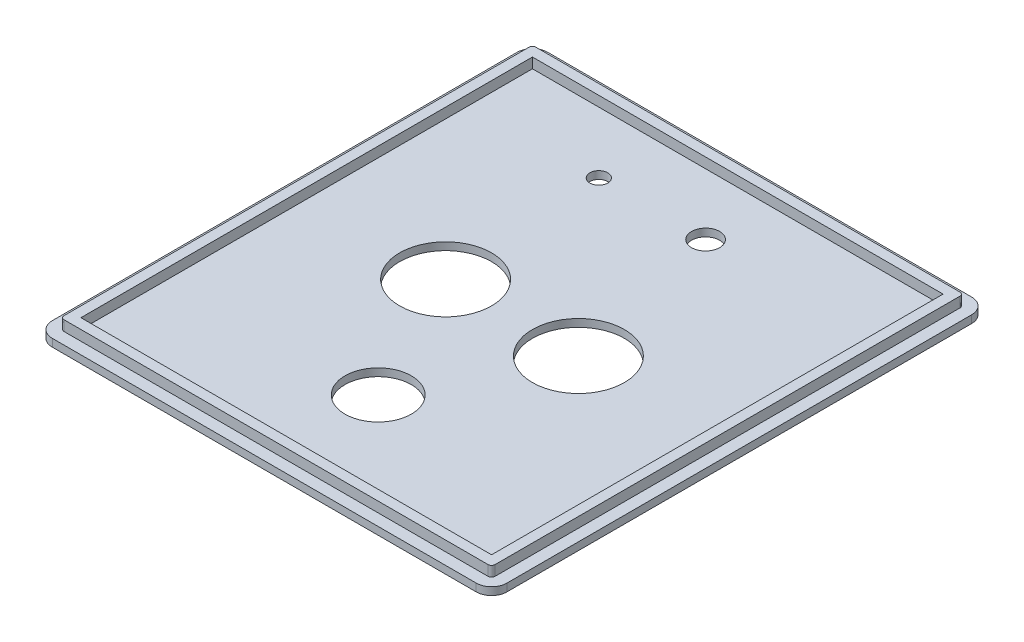
ISO-10303-21;
HEADER;
FILE_DESCRIPTION(('STEP AP214'),'2;1');
FILE_NAME('part.step','',(''),(''),'','','');
FILE_SCHEMA(('AUTOMOTIVE_DESIGN { 1 0 10303 214 1 1 1 1 }'));
ENDSEC;
DATA;
#1=APPLICATION_CONTEXT('core data for automotive mechanical design processes');
#2=APPLICATION_PROTOCOL_DEFINITION('international standard','automotive_design',2000,#1);
#3=PRODUCT_CONTEXT('',#1,'mechanical');
#4=PRODUCT('Part','Part','',(#3));
#5=PRODUCT_RELATED_PRODUCT_CATEGORY('part','',(#4));
#6=PRODUCT_DEFINITION_FORMATION('','',#4);
#7=PRODUCT_DEFINITION_CONTEXT('part definition',#1,'design');
#8=PRODUCT_DEFINITION('design','',#6,#7);
#9=PRODUCT_DEFINITION_SHAPE('','',#8);
#10=(LENGTH_UNIT() NAMED_UNIT(*) SI_UNIT(.MILLI.,.METRE.));
#11=(NAMED_UNIT(*) PLANE_ANGLE_UNIT() SI_UNIT($,.RADIAN.));
#12=(NAMED_UNIT(*) SI_UNIT($,.STERADIAN.) SOLID_ANGLE_UNIT());
#13=UNCERTAINTY_MEASURE_WITH_UNIT(LENGTH_MEASURE(1.E-05),#10,'distance_accuracy_value','');
#14=(GEOMETRIC_REPRESENTATION_CONTEXT(3) GLOBAL_UNCERTAINTY_ASSIGNED_CONTEXT((#13)) GLOBAL_UNIT_ASSIGNED_CONTEXT((#10,
#11,#12)) REPRESENTATION_CONTEXT('',''));
#15=CARTESIAN_POINT('',(0.,0.,0.));
#16=DIRECTION('',(0.,0.,1.));
#17=DIRECTION('',(1.,0.,0.));
#18=AXIS2_PLACEMENT_3D('',#15,#16,#17);
#19=CARTESIAN_POINT('',(3.,1.5,-94.));
#20=DIRECTION('',(0.,-1.,0.));
#21=DIRECTION('',(0.,0.,-1.));
#22=AXIS2_PLACEMENT_3D('',#19,#20,#21);
#23=PLANE('',#22);
#24=CARTESIAN_POINT('',(3.,1.5,-94.));
#25=DIRECTION('',(0.,1.,0.));
#26=DIRECTION('',(0.,0.,-1.));
#27=AXIS2_PLACEMENT_3D('',#24,#25,#26);
#28=CIRCLE('',#27,3.);
#29=CARTESIAN_POINT('',(3.00000000000002,1.5,-97.));
#30=VERTEX_POINT('',#29);
#31=CARTESIAN_POINT('',(0.,1.5,-94.));
#32=VERTEX_POINT('',#31);
#33=EDGE_CURVE('E274',#30,#32,#28,.T.);
#34=ORIENTED_EDGE('',*,*,#33,.T.);
#35=DIRECTION('',(0.,0.,1.));
#36=VECTOR('',#35,1.);
#37=CARTESIAN_POINT('',(0.,1.5,-3.00000000000002));
#38=LINE('',#37,#36);
#39=CARTESIAN_POINT('',(0.,1.5,-3.00000000000002));
#40=VERTEX_POINT('',#39);
#41=EDGE_CURVE('E277',#32,#40,#38,.T.);
#42=ORIENTED_EDGE('',*,*,#41,.T.);
#43=CARTESIAN_POINT('',(3.,1.5,-3.));
#44=DIRECTION('',(0.,1.,0.));
#45=DIRECTION('',(0.,0.,-1.));
#46=AXIS2_PLACEMENT_3D('',#43,#44,#45);
#47=CIRCLE('',#46,3.);
#48=CARTESIAN_POINT('',(3.00000000000002,1.5,0.));
#49=VERTEX_POINT('',#48);
#50=EDGE_CURVE('E280',#40,#49,#47,.T.);
#51=ORIENTED_EDGE('',*,*,#50,.T.);
#52=DIRECTION('',(1.,0.,0.));
#53=VECTOR('',#52,1.);
#54=CARTESIAN_POINT('',(3.00000000000002,1.5,0.));
#55=LINE('',#54,#53);
#56=CARTESIAN_POINT('',(86.,1.5,0.));
#57=VERTEX_POINT('',#56);
#58=EDGE_CURVE('E282',#49,#57,#55,.T.);
#59=ORIENTED_EDGE('',*,*,#58,.T.);
#60=CARTESIAN_POINT('',(86.,1.5,-3.));
#61=DIRECTION('',(0.,1.,0.));
#62=DIRECTION('',(0.,0.,1.));
#63=AXIS2_PLACEMENT_3D('',#60,#61,#62);
#64=CIRCLE('',#63,3.);
#65=CARTESIAN_POINT('',(89.,1.5,-3.00000000000002));
#66=VERTEX_POINT('',#65);
#67=EDGE_CURVE('E284',#57,#66,#64,.T.);
#68=ORIENTED_EDGE('',*,*,#67,.T.);
#69=DIRECTION('',(0.,0.,-1.));
#70=VECTOR('',#69,1.);
#71=CARTESIAN_POINT('',(89.,1.5,-3.00000000000002));
#72=LINE('',#71,#70);
#73=CARTESIAN_POINT('',(89.,1.5,-94.));
#74=VERTEX_POINT('',#73);
#75=EDGE_CURVE('E286',#66,#74,#72,.T.);
#76=ORIENTED_EDGE('',*,*,#75,.T.);
#77=CARTESIAN_POINT('',(86.,1.5,-94.));
#78=DIRECTION('',(0.,1.,0.));
#79=DIRECTION('',(0.,0.,-1.));
#80=AXIS2_PLACEMENT_3D('',#77,#78,#79);
#81=CIRCLE('',#80,3.);
#82=CARTESIAN_POINT('',(86.,1.5,-97.));
#83=VERTEX_POINT('',#82);
#84=EDGE_CURVE('E288',#74,#83,#81,.T.);
#85=ORIENTED_EDGE('',*,*,#84,.T.);
#86=DIRECTION('',(-1.,0.,0.));
#87=VECTOR('',#86,1.);
#88=CARTESIAN_POINT('',(3.00000000000002,1.5,-97.));
#89=LINE('',#88,#87);
#90=EDGE_CURVE('E290',#83,#30,#89,.T.);
#91=ORIENTED_EDGE('',*,*,#90,.T.);
#92=EDGE_LOOP('',(#34,#42,#51,#59,#68,#76,#85,#91));
#93=FACE_BOUND('',#92,.T.);
#94=CARTESIAN_POINT('',(3.,1.5,-94.));
#95=DIRECTION('',(0.,1.,0.));
#96=DIRECTION('',(0.,0.,1.));
#97=AXIS2_PLACEMENT_3D('',#94,#95,#96);
#98=CIRCLE('',#97,0.700000000000004);
#99=CARTESIAN_POINT('',(3.00000000000001,1.5,-94.7));
#100=VERTEX_POINT('',#99);
#101=CARTESIAN_POINT('',(2.3,1.5,-94.));
#102=VERTEX_POINT('',#101);
#103=EDGE_CURVE('E56',#100,#102,#98,.T.);
#104=ORIENTED_EDGE('',*,*,#103,.F.);
#105=DIRECTION('',(-1.,0.,0.));
#106=VECTOR('',#105,1.);
#107=CARTESIAN_POINT('',(86.,1.5,-94.7));
#108=LINE('',#107,#106);
#109=CARTESIAN_POINT('',(86.,1.5,-94.7));
#110=VERTEX_POINT('',#109);
#111=EDGE_CURVE('E215',#110,#100,#108,.T.);
#112=ORIENTED_EDGE('',*,*,#111,.F.);
#113=CARTESIAN_POINT('',(86.,1.5,-94.));
#114=DIRECTION('',(0.,1.,0.));
#115=DIRECTION('',(0.,0.,1.));
#116=AXIS2_PLACEMENT_3D('',#113,#114,#115);
#117=CIRCLE('',#116,0.700000000000006);
#118=CARTESIAN_POINT('',(86.7,1.5,-94.));
#119=VERTEX_POINT('',#118);
#120=EDGE_CURVE('E246',#119,#110,#117,.T.);
#121=ORIENTED_EDGE('',*,*,#120,.F.);
#122=DIRECTION('',(0.,0.,-1.));
#123=VECTOR('',#122,1.);
#124=CARTESIAN_POINT('',(86.7,1.5,-3.));
#125=LINE('',#124,#123);
#126=CARTESIAN_POINT('',(86.7,1.5,-3.));
#127=VERTEX_POINT('',#126);
#128=EDGE_CURVE('E243',#127,#119,#125,.T.);
#129=ORIENTED_EDGE('',*,*,#128,.F.);
#130=CARTESIAN_POINT('',(86.,1.5,-3.));
#131=DIRECTION('',(0.,1.,0.));
#132=DIRECTION('',(0.,0.,1.));
#133=AXIS2_PLACEMENT_3D('',#130,#131,#132);
#134=CIRCLE('',#133,0.700000000000004);
#135=CARTESIAN_POINT('',(86.,1.5,-2.3));
#136=VERTEX_POINT('',#135);
#137=EDGE_CURVE('E240',#136,#127,#134,.T.);
#138=ORIENTED_EDGE('',*,*,#137,.F.);
#139=DIRECTION('',(1.,0.,0.));
#140=VECTOR('',#139,1.);
#141=CARTESIAN_POINT('',(3.,1.5,-2.3));
#142=LINE('',#141,#140);
#143=CARTESIAN_POINT('',(3.,1.5,-2.3));
#144=VERTEX_POINT('',#143);
#145=EDGE_CURVE('E237',#144,#136,#142,.T.);
#146=ORIENTED_EDGE('',*,*,#145,.F.);
#147=CARTESIAN_POINT('',(3.,1.5,-3.));
#148=DIRECTION('',(0.,1.,0.));
#149=DIRECTION('',(0.,0.,1.));
#150=AXIS2_PLACEMENT_3D('',#147,#148,#149);
#151=CIRCLE('',#150,0.7);
#152=CARTESIAN_POINT('',(2.3,1.5,-3.));
#153=VERTEX_POINT('',#152);
#154=EDGE_CURVE('E234',#153,#144,#151,.T.);
#155=ORIENTED_EDGE('',*,*,#154,.F.);
#156=DIRECTION('',(0.,0.,1.));
#157=VECTOR('',#156,1.);
#158=CARTESIAN_POINT('',(2.3,1.5,-94.));
#159=LINE('',#158,#157);
#160=EDGE_CURVE('E231',#102,#153,#159,.T.);
#161=ORIENTED_EDGE('',*,*,#160,.F.);
#162=EDGE_LOOP('',(#104,#112,#121,#129,#138,#146,#155,#161));
#163=FACE_BOUND('',#162,.T.);
#164=ADVANCED_FACE('F33',(#93,#163),#23,.F.);
#165=CARTESIAN_POINT('',(3.,1.5,-94.));
#166=DIRECTION('',(0.,-1.,0.));
#167=DIRECTION('',(0.,0.,-1.));
#168=AXIS2_PLACEMENT_3D('',#165,#166,#167);
#169=CYLINDRICAL_SURFACE('',#168,3.);
#170=CARTESIAN_POINT('',(3.,0.,-94.));
#171=DIRECTION('',(0.,1.,0.));
#172=DIRECTION('',(0.,0.,-1.));
#173=AXIS2_PLACEMENT_3D('',#170,#171,#172);
#174=CIRCLE('',#173,3.);
#175=CARTESIAN_POINT('',(3.00000000000002,0.,-97.));
#176=VERTEX_POINT('',#175);
#177=CARTESIAN_POINT('',(0.,0.,-94.));
#178=VERTEX_POINT('',#177);
#179=EDGE_CURVE('E273',#176,#178,#174,.T.);
#180=ORIENTED_EDGE('',*,*,#179,.T.);
#181=DIRECTION('',(0.,-1.,0.));
#182=VECTOR('',#181,1.);
#183=CARTESIAN_POINT('',(0.,1.5,-94.));
#184=LINE('',#183,#182);
#185=EDGE_CURVE('E11',#32,#178,#184,.T.);
#186=ORIENTED_EDGE('',*,*,#185,.F.);
#187=ORIENTED_EDGE('',*,*,#33,.F.);
#188=DIRECTION('',(0.,-1.,0.));
#189=VECTOR('',#188,1.);
#190=CARTESIAN_POINT('',(3.00000000000002,1.5,-97.));
#191=LINE('',#190,#189);
#192=EDGE_CURVE('E292',#30,#176,#191,.T.);
#193=ORIENTED_EDGE('',*,*,#192,.T.);
#194=EDGE_LOOP('',(#180,#186,#187,#193));
#195=FACE_BOUND('',#194,.T.);
#196=ADVANCED_FACE('F35',(#195),#169,.T.);
#197=CARTESIAN_POINT('',(0.,1.5,-3.00000000000002));
#198=DIRECTION('',(1.,0.,0.));
#199=DIRECTION('',(0.,0.,-1.));
#200=AXIS2_PLACEMENT_3D('',#197,#198,#199);
#201=PLANE('',#200);
#202=DIRECTION('',(0.,0.,1.));
#203=VECTOR('',#202,1.);
#204=CARTESIAN_POINT('',(0.,0.,-3.00000000000002));
#205=LINE('',#204,#203);
#206=CARTESIAN_POINT('',(0.,0.,-3.00000000000002));
#207=VERTEX_POINT('',#206);
#208=EDGE_CURVE('E295',#178,#207,#205,.T.);
#209=ORIENTED_EDGE('',*,*,#208,.T.);
#210=DIRECTION('',(0.,-1.,0.));
#211=VECTOR('',#210,1.);
#212=CARTESIAN_POINT('',(0.,1.5,-3.00000000000002));
#213=LINE('',#212,#211);
#214=EDGE_CURVE('E41',#40,#207,#213,.T.);
#215=ORIENTED_EDGE('',*,*,#214,.F.);
#216=ORIENTED_EDGE('',*,*,#41,.F.);
#217=ORIENTED_EDGE('',*,*,#185,.T.);
#218=EDGE_LOOP('',(#209,#215,#216,#217));
#219=FACE_BOUND('',#218,.T.);
#220=ADVANCED_FACE('F351',(#219),#201,.F.);
#221=CARTESIAN_POINT('',(3.,1.5,-3.));
#222=DIRECTION('',(0.,-1.,0.));
#223=DIRECTION('',(0.,0.,-1.));
#224=AXIS2_PLACEMENT_3D('',#221,#222,#223);
#225=CYLINDRICAL_SURFACE('',#224,3.);
#226=CARTESIAN_POINT('',(3.,0.,-3.));
#227=DIRECTION('',(0.,1.,0.));
#228=DIRECTION('',(0.,0.,-1.));
#229=AXIS2_PLACEMENT_3D('',#226,#227,#228);
#230=CIRCLE('',#229,3.);
#231=CARTESIAN_POINT('',(3.00000000000002,0.,0.));
#232=VERTEX_POINT('',#231);
#233=EDGE_CURVE('E297',#207,#232,#230,.T.);
#234=ORIENTED_EDGE('',*,*,#233,.T.);
#235=DIRECTION('',(0.,-1.,0.));
#236=VECTOR('',#235,1.);
#237=CARTESIAN_POINT('',(3.00000000000002,1.5,0.));
#238=LINE('',#237,#236);
#239=EDGE_CURVE('E322',#49,#232,#238,.T.);
#240=ORIENTED_EDGE('',*,*,#239,.F.);
#241=ORIENTED_EDGE('',*,*,#50,.F.);
#242=ORIENTED_EDGE('',*,*,#214,.T.);
#243=EDGE_LOOP('',(#234,#240,#241,#242));
#244=FACE_BOUND('',#243,.T.);
#245=ADVANCED_FACE('F329',(#244),#225,.T.);
#246=CARTESIAN_POINT('',(3.00000000000002,1.5,0.));
#247=DIRECTION('',(0.,0.,-1.));
#248=DIRECTION('',(-1.,0.,0.));
#249=AXIS2_PLACEMENT_3D('',#246,#247,#248);
#250=PLANE('',#249);
#251=DIRECTION('',(1.,0.,0.));
#252=VECTOR('',#251,1.);
#253=CARTESIAN_POINT('',(3.00000000000002,0.,0.));
#254=LINE('',#253,#252);
#255=CARTESIAN_POINT('',(86.,0.,0.));
#256=VERTEX_POINT('',#255);
#257=EDGE_CURVE('E299',#232,#256,#254,.T.);
#258=ORIENTED_EDGE('',*,*,#257,.T.);
#259=DIRECTION('',(0.,-1.,0.));
#260=VECTOR('',#259,1.);
#261=CARTESIAN_POINT('',(86.,1.5,0.));
#262=LINE('',#261,#260);
#263=EDGE_CURVE('E319',#57,#256,#262,.T.);
#264=ORIENTED_EDGE('',*,*,#263,.F.);
#265=ORIENTED_EDGE('',*,*,#58,.F.);
#266=ORIENTED_EDGE('',*,*,#239,.T.);
#267=EDGE_LOOP('',(#258,#264,#265,#266));
#268=FACE_BOUND('',#267,.T.);
#269=ADVANCED_FACE('F340',(#268),#250,.F.);
#270=CARTESIAN_POINT('',(86.,1.5,-3.));
#271=DIRECTION('',(0.,-1.,0.));
#272=DIRECTION('',(0.,0.,-1.));
#273=AXIS2_PLACEMENT_3D('',#270,#271,#272);
#274=CYLINDRICAL_SURFACE('',#273,3.);
#275=CARTESIAN_POINT('',(86.,0.,-3.));
#276=DIRECTION('',(0.,1.,0.));
#277=DIRECTION('',(0.,0.,1.));
#278=AXIS2_PLACEMENT_3D('',#275,#276,#277);
#279=CIRCLE('',#278,3.);
#280=CARTESIAN_POINT('',(89.,0.,-3.00000000000002));
#281=VERTEX_POINT('',#280);
#282=EDGE_CURVE('E301',#256,#281,#279,.T.);
#283=ORIENTED_EDGE('',*,*,#282,.T.);
#284=DIRECTION('',(0.,-1.,0.));
#285=VECTOR('',#284,1.);
#286=CARTESIAN_POINT('',(89.,1.5,-3.00000000000002));
#287=LINE('',#286,#285);
#288=EDGE_CURVE('E316',#66,#281,#287,.T.);
#289=ORIENTED_EDGE('',*,*,#288,.F.);
#290=ORIENTED_EDGE('',*,*,#67,.F.);
#291=ORIENTED_EDGE('',*,*,#263,.T.);
#292=EDGE_LOOP('',(#283,#289,#290,#291));
#293=FACE_BOUND('',#292,.T.);
#294=ADVANCED_FACE('F344',(#293),#274,.T.);
#295=CARTESIAN_POINT('',(89.,1.5,-3.00000000000002));
#296=DIRECTION('',(-1.,0.,0.));
#297=DIRECTION('',(0.,0.,1.));
#298=AXIS2_PLACEMENT_3D('',#295,#296,#297);
#299=PLANE('',#298);
#300=DIRECTION('',(0.,0.,-1.));
#301=VECTOR('',#300,1.);
#302=CARTESIAN_POINT('',(89.,0.,-3.00000000000002));
#303=LINE('',#302,#301);
#304=CARTESIAN_POINT('',(89.,0.,-94.));
#305=VERTEX_POINT('',#304);
#306=EDGE_CURVE('E303',#281,#305,#303,.T.);
#307=ORIENTED_EDGE('',*,*,#306,.T.);
#308=DIRECTION('',(0.,-1.,0.));
#309=VECTOR('',#308,1.);
#310=CARTESIAN_POINT('',(89.,1.5,-94.));
#311=LINE('',#310,#309);
#312=EDGE_CURVE('E313',#74,#305,#311,.T.);
#313=ORIENTED_EDGE('',*,*,#312,.F.);
#314=ORIENTED_EDGE('',*,*,#75,.F.);
#315=ORIENTED_EDGE('',*,*,#288,.T.);
#316=EDGE_LOOP('',(#307,#313,#314,#315));
#317=FACE_BOUND('',#316,.T.);
#318=ADVANCED_FACE('F364',(#317),#299,.F.);
#319=CARTESIAN_POINT('',(86.,1.5,-94.));
#320=DIRECTION('',(0.,-1.,0.));
#321=DIRECTION('',(0.,0.,-1.));
#322=AXIS2_PLACEMENT_3D('',#319,#320,#321);
#323=CYLINDRICAL_SURFACE('',#322,3.);
#324=CARTESIAN_POINT('',(86.,0.,-94.));
#325=DIRECTION('',(0.,1.,0.));
#326=DIRECTION('',(0.,0.,-1.));
#327=AXIS2_PLACEMENT_3D('',#324,#325,#326);
#328=CIRCLE('',#327,3.);
#329=CARTESIAN_POINT('',(86.,0.,-97.));
#330=VERTEX_POINT('',#329);
#331=EDGE_CURVE('E305',#305,#330,#328,.T.);
#332=ORIENTED_EDGE('',*,*,#331,.T.);
#333=DIRECTION('',(0.,-1.,0.));
#334=VECTOR('',#333,1.);
#335=CARTESIAN_POINT('',(86.,1.5,-97.));
#336=LINE('',#335,#334);
#337=EDGE_CURVE('E310',#83,#330,#336,.T.);
#338=ORIENTED_EDGE('',*,*,#337,.F.);
#339=ORIENTED_EDGE('',*,*,#84,.F.);
#340=ORIENTED_EDGE('',*,*,#312,.T.);
#341=EDGE_LOOP('',(#332,#338,#339,#340));
#342=FACE_BOUND('',#341,.T.);
#343=ADVANCED_FACE('F362',(#342),#323,.T.);
#344=CARTESIAN_POINT('',(3.00000000000002,1.5,-97.));
#345=DIRECTION('',(0.,0.,1.));
#346=DIRECTION('',(1.,0.,0.));
#347=AXIS2_PLACEMENT_3D('',#344,#345,#346);
#348=PLANE('',#347);
#349=DIRECTION('',(-1.,0.,0.));
#350=VECTOR('',#349,1.);
#351=CARTESIAN_POINT('',(3.00000000000002,0.,-97.));
#352=LINE('',#351,#350);
#353=EDGE_CURVE('E278',#330,#176,#352,.T.);
#354=ORIENTED_EDGE('',*,*,#353,.T.);
#355=ORIENTED_EDGE('',*,*,#192,.F.);
#356=ORIENTED_EDGE('',*,*,#90,.F.);
#357=ORIENTED_EDGE('',*,*,#337,.T.);
#358=EDGE_LOOP('',(#354,#355,#356,#357));
#359=FACE_BOUND('',#358,.T.);
#360=ADVANCED_FACE('F357',(#359),#348,.F.);
#361=CARTESIAN_POINT('',(3.,0.,-94.));
#362=DIRECTION('',(0.,-1.,0.));
#363=DIRECTION('',(0.,0.,-1.));
#364=AXIS2_PLACEMENT_3D('',#361,#362,#363);
#365=PLANE('',#364);
#366=CARTESIAN_POINT('',(44.5,0.,-22.3));
#367=DIRECTION('',(0.,-1.,0.));
#368=DIRECTION('',(0.,0.,-1.));
#369=AXIS2_PLACEMENT_3D('',#366,#367,#368);
#370=CIRCLE('',#369,6.5);
#371=CARTESIAN_POINT('',(44.5,0.,-28.8));
#372=VERTEX_POINT('',#371);
#373=EDGE_CURVE('E632',#372,#372,#370,.T.);
#374=ORIENTED_EDGE('',*,*,#373,.F.);
#375=EDGE_LOOP('',(#374));
#376=FACE_BOUND('',#375,.T.);
#377=CARTESIAN_POINT('',(29.3,0.,-80.7));
#378=DIRECTION('',(0.,-1.,0.));
#379=DIRECTION('',(0.,0.,-1.));
#380=AXIS2_PLACEMENT_3D('',#377,#378,#379);
#381=CIRCLE('',#380,1.75);
#382=CARTESIAN_POINT('',(29.3,0.,-82.45));
#383=VERTEX_POINT('',#382);
#384=EDGE_CURVE('E648',#383,#383,#381,.T.);
#385=ORIENTED_EDGE('',*,*,#384,.F.);
#386=EDGE_LOOP('',(#385));
#387=FACE_BOUND('',#386,.T.);
#388=CARTESIAN_POINT('',(50.2,0.,-80.7));
#389=DIRECTION('',(0.,-1.,0.));
#390=DIRECTION('',(0.,0.,-1.));
#391=AXIS2_PLACEMENT_3D('',#388,#389,#390);
#392=CIRCLE('',#391,2.75);
#393=CARTESIAN_POINT('',(50.2,0.,-83.45));
#394=VERTEX_POINT('',#393);
#395=EDGE_CURVE('E643',#394,#394,#392,.T.);
#396=ORIENTED_EDGE('',*,*,#395,.F.);
#397=EDGE_LOOP('',(#396));
#398=FACE_BOUND('',#397,.T.);
#399=CARTESIAN_POINT('',(31.5,0.,-48.5));
#400=DIRECTION('',(0.,-1.,0.));
#401=DIRECTION('',(0.,0.,-1.));
#402=AXIS2_PLACEMENT_3D('',#399,#400,#401);
#403=CIRCLE('',#402,9.00000000000001);
#404=CARTESIAN_POINT('',(31.5,0.,-57.5));
#405=VERTEX_POINT('',#404);
#406=EDGE_CURVE('E196',#405,#405,#403,.T.);
#407=ORIENTED_EDGE('',*,*,#406,.F.);
#408=EDGE_LOOP('',(#407));
#409=FACE_BOUND('',#408,.T.);
#410=CARTESIAN_POINT('',(57.5,0.,-48.5));
#411=DIRECTION('',(0.,-1.,0.));
#412=DIRECTION('',(0.,0.,-1.));
#413=AXIS2_PLACEMENT_3D('',#410,#411,#412);
#414=CIRCLE('',#413,9.00000000000001);
#415=CARTESIAN_POINT('',(57.5,0.,-57.5));
#416=VERTEX_POINT('',#415);
#417=EDGE_CURVE('E655',#416,#416,#414,.T.);
#418=ORIENTED_EDGE('',*,*,#417,.F.);
#419=EDGE_LOOP('',(#418));
#420=FACE_BOUND('',#419,.T.);
#421=ORIENTED_EDGE('',*,*,#179,.F.);
#422=ORIENTED_EDGE('',*,*,#353,.F.);
#423=ORIENTED_EDGE('',*,*,#331,.F.);
#424=ORIENTED_EDGE('',*,*,#306,.F.);
#425=ORIENTED_EDGE('',*,*,#282,.F.);
#426=ORIENTED_EDGE('',*,*,#257,.F.);
#427=ORIENTED_EDGE('',*,*,#233,.F.);
#428=ORIENTED_EDGE('',*,*,#208,.F.);
#429=EDGE_LOOP('',(#421,#422,#423,#424,#425,#426,#427,#428));
#430=FACE_BOUND('',#429,.T.);
#431=ADVANCED_FACE('F335',(#376,#387,#398,#409,#420,#430),#365,.T.);
#432=CARTESIAN_POINT('',(3.,3.5,-94.));
#433=DIRECTION('',(0.,-1.,0.));
#434=DIRECTION('',(0.,0.,-1.));
#435=AXIS2_PLACEMENT_3D('',#432,#433,#434);
#436=CYLINDRICAL_SURFACE('',#435,0.700000000000004);
#437=ORIENTED_EDGE('',*,*,#103,.T.);
#438=DIRECTION('',(0.,-1.,0.));
#439=VECTOR('',#438,1.);
#440=CARTESIAN_POINT('',(2.3,3.5,-94.));
#441=LINE('',#440,#439);
#442=CARTESIAN_POINT('',(2.3,3.5,-94.));
#443=VERTEX_POINT('',#442);
#444=EDGE_CURVE('E270',#443,#102,#441,.T.);
#445=ORIENTED_EDGE('',*,*,#444,.F.);
#446=CARTESIAN_POINT('',(3.,3.5,-94.));
#447=DIRECTION('',(0.,1.,0.));
#448=DIRECTION('',(0.,0.,1.));
#449=AXIS2_PLACEMENT_3D('',#446,#447,#448);
#450=CIRCLE('',#449,0.700000000000004);
#451=CARTESIAN_POINT('',(3.00000000000001,3.5,-94.7));
#452=VERTEX_POINT('',#451);
#453=EDGE_CURVE('E211',#452,#443,#450,.T.);
#454=ORIENTED_EDGE('',*,*,#453,.F.);
#455=DIRECTION('',(0.,-1.,0.));
#456=VECTOR('',#455,1.);
#457=CARTESIAN_POINT('',(3.00000000000001,3.5,-94.7));
#458=LINE('',#457,#456);
#459=EDGE_CURVE('E229',#452,#100,#458,.T.);
#460=ORIENTED_EDGE('',*,*,#459,.T.);
#461=EDGE_LOOP('',(#437,#445,#454,#460));
#462=FACE_BOUND('',#461,.T.);
#463=ADVANCED_FACE('F380',(#462),#436,.T.);
#464=CARTESIAN_POINT('',(2.3,3.5,-94.));
#465=DIRECTION('',(1.,0.,0.));
#466=DIRECTION('',(0.,0.,-1.));
#467=AXIS2_PLACEMENT_3D('',#464,#465,#466);
#468=PLANE('',#467);
#469=ORIENTED_EDGE('',*,*,#160,.T.);
#470=DIRECTION('',(0.,-1.,0.));
#471=VECTOR('',#470,1.);
#472=CARTESIAN_POINT('',(2.3,3.5,-3.));
#473=LINE('',#472,#471);
#474=CARTESIAN_POINT('',(2.3,3.5,-3.));
#475=VERTEX_POINT('',#474);
#476=EDGE_CURVE('E267',#475,#153,#473,.T.);
#477=ORIENTED_EDGE('',*,*,#476,.F.);
#478=DIRECTION('',(0.,0.,1.));
#479=VECTOR('',#478,1.);
#480=CARTESIAN_POINT('',(2.3,3.5,-94.));
#481=LINE('',#480,#479);
#482=EDGE_CURVE('E214',#443,#475,#481,.T.);
#483=ORIENTED_EDGE('',*,*,#482,.F.);
#484=ORIENTED_EDGE('',*,*,#444,.T.);
#485=EDGE_LOOP('',(#469,#477,#483,#484));
#486=FACE_BOUND('',#485,.T.);
#487=ADVANCED_FACE('F402',(#486),#468,.F.);
#488=CARTESIAN_POINT('',(3.,3.5,-3.));
#489=DIRECTION('',(0.,-1.,0.));
#490=DIRECTION('',(0.,0.,-1.));
#491=AXIS2_PLACEMENT_3D('',#488,#489,#490);
#492=CYLINDRICAL_SURFACE('',#491,0.7);
#493=ORIENTED_EDGE('',*,*,#154,.T.);
#494=DIRECTION('',(0.,-1.,0.));
#495=VECTOR('',#494,1.);
#496=CARTESIAN_POINT('',(3.,3.5,-2.3));
#497=LINE('',#496,#495);
#498=CARTESIAN_POINT('',(3.,3.5,-2.3));
#499=VERTEX_POINT('',#498);
#500=EDGE_CURVE('E264',#499,#144,#497,.T.);
#501=ORIENTED_EDGE('',*,*,#500,.F.);
#502=CARTESIAN_POINT('',(3.,3.5,-3.));
#503=DIRECTION('',(0.,1.,0.));
#504=DIRECTION('',(0.,0.,1.));
#505=AXIS2_PLACEMENT_3D('',#502,#503,#504);
#506=CIRCLE('',#505,0.7);
#507=EDGE_CURVE('E217',#475,#499,#506,.T.);
#508=ORIENTED_EDGE('',*,*,#507,.F.);
#509=ORIENTED_EDGE('',*,*,#476,.T.);
#510=EDGE_LOOP('',(#493,#501,#508,#509));
#511=FACE_BOUND('',#510,.T.);
#512=ADVANCED_FACE('F409',(#511),#492,.T.);
#513=CARTESIAN_POINT('',(3.,3.5,-2.3));
#514=DIRECTION('',(0.,0.,-1.));
#515=DIRECTION('',(-1.,0.,0.));
#516=AXIS2_PLACEMENT_3D('',#513,#514,#515);
#517=PLANE('',#516);
#518=ORIENTED_EDGE('',*,*,#145,.T.);
#519=DIRECTION('',(0.,-1.,0.));
#520=VECTOR('',#519,1.);
#521=CARTESIAN_POINT('',(86.,3.5,-2.3));
#522=LINE('',#521,#520);
#523=CARTESIAN_POINT('',(86.,3.5,-2.3));
#524=VERTEX_POINT('',#523);
#525=EDGE_CURVE('E261',#524,#136,#522,.T.);
#526=ORIENTED_EDGE('',*,*,#525,.F.);
#527=DIRECTION('',(1.,0.,0.));
#528=VECTOR('',#527,1.);
#529=CARTESIAN_POINT('',(3.,3.5,-2.3));
#530=LINE('',#529,#528);
#531=EDGE_CURVE('E219',#499,#524,#530,.T.);
#532=ORIENTED_EDGE('',*,*,#531,.F.);
#533=ORIENTED_EDGE('',*,*,#500,.T.);
#534=EDGE_LOOP('',(#518,#526,#532,#533));
#535=FACE_BOUND('',#534,.T.);
#536=ADVANCED_FACE('F416',(#535),#517,.F.);
#537=CARTESIAN_POINT('',(86.,3.5,-3.));
#538=DIRECTION('',(0.,-1.,0.));
#539=DIRECTION('',(0.,0.,-1.));
#540=AXIS2_PLACEMENT_3D('',#537,#538,#539);
#541=CYLINDRICAL_SURFACE('',#540,0.700000000000004);
#542=ORIENTED_EDGE('',*,*,#137,.T.);
#543=DIRECTION('',(0.,-1.,0.));
#544=VECTOR('',#543,1.);
#545=CARTESIAN_POINT('',(86.7,3.5,-3.));
#546=LINE('',#545,#544);
#547=CARTESIAN_POINT('',(86.7,3.5,-3.));
#548=VERTEX_POINT('',#547);
#549=EDGE_CURVE('E258',#548,#127,#546,.T.);
#550=ORIENTED_EDGE('',*,*,#549,.F.);
#551=CARTESIAN_POINT('',(86.,3.5,-3.));
#552=DIRECTION('',(0.,1.,0.));
#553=DIRECTION('',(0.,0.,1.));
#554=AXIS2_PLACEMENT_3D('',#551,#552,#553);
#555=CIRCLE('',#554,0.700000000000004);
#556=EDGE_CURVE('E221',#524,#548,#555,.T.);
#557=ORIENTED_EDGE('',*,*,#556,.F.);
#558=ORIENTED_EDGE('',*,*,#525,.T.);
#559=EDGE_LOOP('',(#542,#550,#557,#558));
#560=FACE_BOUND('',#559,.T.);
#561=ADVANCED_FACE('F424',(#560),#541,.T.);
#562=CARTESIAN_POINT('',(86.7,3.5,-3.));
#563=DIRECTION('',(-1.,0.,0.));
#564=DIRECTION('',(0.,0.,1.));
#565=AXIS2_PLACEMENT_3D('',#562,#563,#564);
#566=PLANE('',#565);
#567=ORIENTED_EDGE('',*,*,#128,.T.);
#568=DIRECTION('',(0.,-1.,0.));
#569=VECTOR('',#568,1.);
#570=CARTESIAN_POINT('',(86.7,3.5,-94.));
#571=LINE('',#570,#569);
#572=CARTESIAN_POINT('',(86.7,3.5,-94.));
#573=VERTEX_POINT('',#572);
#574=EDGE_CURVE('E255',#573,#119,#571,.T.);
#575=ORIENTED_EDGE('',*,*,#574,.F.);
#576=DIRECTION('',(0.,0.,-1.));
#577=VECTOR('',#576,1.);
#578=CARTESIAN_POINT('',(86.7,3.5,-3.));
#579=LINE('',#578,#577);
#580=EDGE_CURVE('E223',#548,#573,#579,.T.);
#581=ORIENTED_EDGE('',*,*,#580,.F.);
#582=ORIENTED_EDGE('',*,*,#549,.T.);
#583=EDGE_LOOP('',(#567,#575,#581,#582));
#584=FACE_BOUND('',#583,.T.);
#585=ADVANCED_FACE('F432',(#584),#566,.F.);
#586=CARTESIAN_POINT('',(86.,3.5,-94.));
#587=DIRECTION('',(0.,-1.,0.));
#588=DIRECTION('',(0.,0.,-1.));
#589=AXIS2_PLACEMENT_3D('',#586,#587,#588);
#590=CYLINDRICAL_SURFACE('',#589,0.700000000000006);
#591=ORIENTED_EDGE('',*,*,#120,.T.);
#592=DIRECTION('',(0.,-1.,0.));
#593=VECTOR('',#592,1.);
#594=CARTESIAN_POINT('',(86.,3.5,-94.7));
#595=LINE('',#594,#593);
#596=CARTESIAN_POINT('',(86.,3.5,-94.7));
#597=VERTEX_POINT('',#596);
#598=EDGE_CURVE('E252',#597,#110,#595,.T.);
#599=ORIENTED_EDGE('',*,*,#598,.F.);
#600=CARTESIAN_POINT('',(86.,3.5,-94.));
#601=DIRECTION('',(0.,1.,0.));
#602=DIRECTION('',(0.,0.,1.));
#603=AXIS2_PLACEMENT_3D('',#600,#601,#602);
#604=CIRCLE('',#603,0.700000000000006);
#605=EDGE_CURVE('E225',#573,#597,#604,.T.);
#606=ORIENTED_EDGE('',*,*,#605,.F.);
#607=ORIENTED_EDGE('',*,*,#574,.T.);
#608=EDGE_LOOP('',(#591,#599,#606,#607));
#609=FACE_BOUND('',#608,.T.);
#610=ADVANCED_FACE('F440',(#609),#590,.T.);
#611=CARTESIAN_POINT('',(86.,3.5,-94.7));
#612=DIRECTION('',(0.,0.,1.));
#613=DIRECTION('',(1.,0.,0.));
#614=AXIS2_PLACEMENT_3D('',#611,#612,#613);
#615=PLANE('',#614);
#616=ORIENTED_EDGE('',*,*,#111,.T.);
#617=ORIENTED_EDGE('',*,*,#459,.F.);
#618=DIRECTION('',(-1.,0.,0.));
#619=VECTOR('',#618,1.);
#620=CARTESIAN_POINT('',(86.,3.5,-94.7));
#621=LINE('',#620,#619);
#622=EDGE_CURVE('E227',#597,#452,#621,.T.);
#623=ORIENTED_EDGE('',*,*,#622,.F.);
#624=ORIENTED_EDGE('',*,*,#598,.T.);
#625=EDGE_LOOP('',(#616,#617,#623,#624));
#626=FACE_BOUND('',#625,.T.);
#627=ADVANCED_FACE('F448',(#626),#615,.F.);
#628=CARTESIAN_POINT('',(3.,3.5,-94.));
#629=DIRECTION('',(0.,1.,0.));
#630=DIRECTION('',(0.,0.,1.));
#631=AXIS2_PLACEMENT_3D('',#628,#629,#630);
#632=PLANE('',#631);
#633=DIRECTION('',(0.,0.,1.));
#634=VECTOR('',#633,1.);
#635=CARTESIAN_POINT('',(4.3,3.5,-92.7));
#636=LINE('',#635,#634);
#637=CARTESIAN_POINT('',(4.3,3.5,-92.7));
#638=VERTEX_POINT('',#637);
#639=CARTESIAN_POINT('',(4.30000000000001,3.5,-4.3));
#640=VERTEX_POINT('',#639);
#641=EDGE_CURVE('E48',#638,#640,#636,.T.);
#642=ORIENTED_EDGE('',*,*,#641,.F.);
#643=DIRECTION('',(-1.,0.,0.));
#644=VECTOR('',#643,1.);
#645=CARTESIAN_POINT('',(4.3,3.5,-92.7));
#646=LINE('',#645,#644);
#647=CARTESIAN_POINT('',(84.7,3.5,-92.7));
#648=VERTEX_POINT('',#647);
#649=EDGE_CURVE('E190',#648,#638,#646,.T.);
#650=ORIENTED_EDGE('',*,*,#649,.F.);
#651=DIRECTION('',(0.,0.,-1.));
#652=VECTOR('',#651,1.);
#653=CARTESIAN_POINT('',(84.7,3.5,-92.7));
#654=LINE('',#653,#652);
#655=CARTESIAN_POINT('',(84.7,3.5,-4.3));
#656=VERTEX_POINT('',#655);
#657=EDGE_CURVE('E193',#656,#648,#654,.T.);
#658=ORIENTED_EDGE('',*,*,#657,.F.);
#659=DIRECTION('',(1.,0.,0.));
#660=VECTOR('',#659,1.);
#661=CARTESIAN_POINT('',(4.30000000000001,3.5,-4.3));
#662=LINE('',#661,#660);
#663=EDGE_CURVE('E202',#640,#656,#662,.T.);
#664=ORIENTED_EDGE('',*,*,#663,.F.);
#665=EDGE_LOOP('',(#642,#650,#658,#664));
#666=FACE_BOUND('',#665,.T.);
#667=ORIENTED_EDGE('',*,*,#453,.T.);
#668=ORIENTED_EDGE('',*,*,#482,.T.);
#669=ORIENTED_EDGE('',*,*,#507,.T.);
#670=ORIENTED_EDGE('',*,*,#531,.T.);
#671=ORIENTED_EDGE('',*,*,#556,.T.);
#672=ORIENTED_EDGE('',*,*,#580,.T.);
#673=ORIENTED_EDGE('',*,*,#605,.T.);
#674=ORIENTED_EDGE('',*,*,#622,.T.);
#675=EDGE_LOOP('',(#667,#668,#669,#670,#671,#672,#673,#674));
#676=FACE_BOUND('',#675,.T.);
#677=ADVANCED_FACE('F456',(#666,#676),#632,.T.);
#678=CARTESIAN_POINT('',(4.3,1.5,-92.7));
#679=DIRECTION('',(-1.,0.,0.));
#680=DIRECTION('',(0.,0.,1.));
#681=AXIS2_PLACEMENT_3D('',#678,#679,#680);
#682=PLANE('',#681);
#683=ORIENTED_EDGE('',*,*,#641,.T.);
#684=DIRECTION('',(0.,1.,0.));
#685=VECTOR('',#684,1.);
#686=CARTESIAN_POINT('',(4.30000000000001,1.5,-4.3));
#687=LINE('',#686,#685);
#688=CARTESIAN_POINT('',(4.30000000000001,1.5,-4.3));
#689=VERTEX_POINT('',#688);
#690=EDGE_CURVE('E168',#689,#640,#687,.T.);
#691=ORIENTED_EDGE('',*,*,#690,.F.);
#692=DIRECTION('',(0.,0.,1.));
#693=VECTOR('',#692,1.);
#694=CARTESIAN_POINT('',(4.3,1.5,-92.7));
#695=LINE('',#694,#693);
#696=CARTESIAN_POINT('',(4.3,1.5,-92.7));
#697=VERTEX_POINT('',#696);
#698=EDGE_CURVE('E172',#697,#689,#695,.T.);
#699=ORIENTED_EDGE('',*,*,#698,.F.);
#700=DIRECTION('',(0.,1.,0.));
#701=VECTOR('',#700,1.);
#702=CARTESIAN_POINT('',(4.3,1.5,-92.7));
#703=LINE('',#702,#701);
#704=EDGE_CURVE('E206',#697,#638,#703,.T.);
#705=ORIENTED_EDGE('',*,*,#704,.T.);
#706=EDGE_LOOP('',(#683,#691,#699,#705));
#707=FACE_BOUND('',#706,.T.);
#708=ADVANCED_FACE('F170',(#707),#682,.F.);
#709=CARTESIAN_POINT('',(4.3,1.5,-92.7));
#710=DIRECTION('',(0.,0.,-1.));
#711=DIRECTION('',(-1.,0.,0.));
#712=AXIS2_PLACEMENT_3D('',#709,#710,#711);
#713=PLANE('',#712);
#714=ORIENTED_EDGE('',*,*,#649,.T.);
#715=ORIENTED_EDGE('',*,*,#704,.F.);
#716=DIRECTION('',(-1.,0.,0.));
#717=VECTOR('',#716,1.);
#718=CARTESIAN_POINT('',(4.3,1.5,-92.7));
#719=LINE('',#718,#717);
#720=CARTESIAN_POINT('',(84.7,1.5,-92.7));
#721=VERTEX_POINT('',#720);
#722=EDGE_CURVE('E178',#721,#697,#719,.T.);
#723=ORIENTED_EDGE('',*,*,#722,.F.);
#724=DIRECTION('',(0.,1.,0.));
#725=VECTOR('',#724,1.);
#726=CARTESIAN_POINT('',(84.7,1.5,-92.7));
#727=LINE('',#726,#725);
#728=EDGE_CURVE('E208',#721,#648,#727,.T.);
#729=ORIENTED_EDGE('',*,*,#728,.T.);
#730=EDGE_LOOP('',(#714,#715,#723,#729));
#731=FACE_BOUND('',#730,.T.);
#732=ADVANCED_FACE('F471',(#731),#713,.F.);
#733=CARTESIAN_POINT('',(84.7,1.5,-92.7));
#734=DIRECTION('',(1.,0.,0.));
#735=DIRECTION('',(0.,0.,-1.));
#736=AXIS2_PLACEMENT_3D('',#733,#734,#735);
#737=PLANE('',#736);
#738=ORIENTED_EDGE('',*,*,#657,.T.);
#739=ORIENTED_EDGE('',*,*,#728,.F.);
#740=DIRECTION('',(0.,0.,-1.));
#741=VECTOR('',#740,1.);
#742=CARTESIAN_POINT('',(84.7,1.5,-92.7));
#743=LINE('',#742,#741);
#744=CARTESIAN_POINT('',(84.7,1.5,-4.3));
#745=VERTEX_POINT('',#744);
#746=EDGE_CURVE('E186',#745,#721,#743,.T.);
#747=ORIENTED_EDGE('',*,*,#746,.F.);
#748=DIRECTION('',(0.,1.,0.));
#749=VECTOR('',#748,1.);
#750=CARTESIAN_POINT('',(84.7,1.5,-4.3));
#751=LINE('',#750,#749);
#752=EDGE_CURVE('E177',#745,#656,#751,.T.);
#753=ORIENTED_EDGE('',*,*,#752,.T.);
#754=EDGE_LOOP('',(#738,#739,#747,#753));
#755=FACE_BOUND('',#754,.T.);
#756=ADVANCED_FACE('F478',(#755),#737,.F.);
#757=CARTESIAN_POINT('',(4.30000000000001,1.5,-4.3));
#758=DIRECTION('',(0.,0.,1.));
#759=DIRECTION('',(1.,0.,0.));
#760=AXIS2_PLACEMENT_3D('',#757,#758,#759);
#761=PLANE('',#760);
#762=ORIENTED_EDGE('',*,*,#663,.T.);
#763=ORIENTED_EDGE('',*,*,#752,.F.);
#764=DIRECTION('',(1.,0.,0.));
#765=VECTOR('',#764,1.);
#766=CARTESIAN_POINT('',(4.30000000000001,1.5,-4.3));
#767=LINE('',#766,#765);
#768=EDGE_CURVE('E181',#689,#745,#767,.T.);
#769=ORIENTED_EDGE('',*,*,#768,.F.);
#770=ORIENTED_EDGE('',*,*,#690,.T.);
#771=EDGE_LOOP('',(#762,#763,#769,#770));
#772=FACE_BOUND('',#771,.T.);
#773=ADVANCED_FACE('F182',(#772),#761,.F.);
#774=CARTESIAN_POINT('',(0.,1.5,0.));
#775=DIRECTION('',(0.,1.,0.));
#776=DIRECTION('',(0.,0.,1.));
#777=AXIS2_PLACEMENT_3D('',#774,#775,#776);
#778=PLANE('',#777);
#779=CARTESIAN_POINT('',(44.5,1.5,-22.3));
#780=DIRECTION('',(0.,1.,0.));
#781=DIRECTION('',(0.,0.,1.));
#782=AXIS2_PLACEMENT_3D('',#779,#780,#781);
#783=CIRCLE('',#782,6.5);
#784=CARTESIAN_POINT('',(44.5,1.5,-15.8));
#785=VERTEX_POINT('',#784);
#786=EDGE_CURVE('E635',#785,#785,#783,.T.);
#787=ORIENTED_EDGE('',*,*,#786,.F.);
#788=EDGE_LOOP('',(#787));
#789=FACE_BOUND('',#788,.T.);
#790=CARTESIAN_POINT('',(29.3,1.5,-80.7));
#791=DIRECTION('',(0.,1.,0.));
#792=DIRECTION('',(0.,0.,1.));
#793=AXIS2_PLACEMENT_3D('',#790,#791,#792);
#794=CIRCLE('',#793,1.75);
#795=CARTESIAN_POINT('',(29.3,1.5,-78.95));
#796=VERTEX_POINT('',#795);
#797=EDGE_CURVE('E640',#796,#796,#794,.T.);
#798=ORIENTED_EDGE('',*,*,#797,.F.);
#799=EDGE_LOOP('',(#798));
#800=FACE_BOUND('',#799,.T.);
#801=CARTESIAN_POINT('',(50.2,1.5,-80.7));
#802=DIRECTION('',(0.,1.,0.));
#803=DIRECTION('',(0.,0.,1.));
#804=AXIS2_PLACEMENT_3D('',#801,#802,#803);
#805=CIRCLE('',#804,2.75);
#806=CARTESIAN_POINT('',(50.2,1.5,-77.95));
#807=VERTEX_POINT('',#806);
#808=EDGE_CURVE('E637',#807,#807,#805,.T.);
#809=ORIENTED_EDGE('',*,*,#808,.F.);
#810=EDGE_LOOP('',(#809));
#811=FACE_BOUND('',#810,.T.);
#812=CARTESIAN_POINT('',(31.5,1.5,-48.5));
#813=DIRECTION('',(0.,1.,0.));
#814=DIRECTION('',(0.,0.,1.));
#815=AXIS2_PLACEMENT_3D('',#812,#813,#814);
#816=CIRCLE('',#815,9.00000000000001);
#817=CARTESIAN_POINT('',(31.5,1.5,-39.5));
#818=VERTEX_POINT('',#817);
#819=EDGE_CURVE('E652',#818,#818,#816,.T.);
#820=ORIENTED_EDGE('',*,*,#819,.F.);
#821=EDGE_LOOP('',(#820));
#822=FACE_BOUND('',#821,.T.);
#823=CARTESIAN_POINT('',(57.5,1.5,-48.5));
#824=DIRECTION('',(0.,1.,0.));
#825=DIRECTION('',(0.,0.,1.));
#826=AXIS2_PLACEMENT_3D('',#823,#824,#825);
#827=CIRCLE('',#826,9.00000000000001);
#828=CARTESIAN_POINT('',(57.5,1.5,-39.5));
#829=VERTEX_POINT('',#828);
#830=EDGE_CURVE('E651',#829,#829,#827,.T.);
#831=ORIENTED_EDGE('',*,*,#830,.F.);
#832=EDGE_LOOP('',(#831));
#833=FACE_BOUND('',#832,.T.);
#834=ORIENTED_EDGE('',*,*,#698,.T.);
#835=ORIENTED_EDGE('',*,*,#768,.T.);
#836=ORIENTED_EDGE('',*,*,#746,.T.);
#837=ORIENTED_EDGE('',*,*,#722,.T.);
#838=EDGE_LOOP('',(#834,#835,#836,#837));
#839=FACE_BOUND('',#838,.T.);
#840=ADVANCED_FACE('F188',(#789,#800,#811,#822,#833,#839),#778,.T.);
#841=CARTESIAN_POINT('',(57.5,-0.5,-48.5));
#842=DIRECTION('',(0.,1.,0.));
#843=DIRECTION('',(0.,0.,1.));
#844=AXIS2_PLACEMENT_3D('',#841,#842,#843);
#845=CYLINDRICAL_SURFACE('',#844,9.00000000000001);
#846=ORIENTED_EDGE('',*,*,#417,.T.);
#847=EDGE_LOOP('',(#846));
#848=FACE_BOUND('',#847,.T.);
#849=ORIENTED_EDGE('',*,*,#830,.T.);
#850=EDGE_LOOP('',(#849));
#851=FACE_BOUND('',#850,.T.);
#852=ADVANCED_FACE('F499',(#848,#851),#845,.F.);
#853=CARTESIAN_POINT('',(31.5,-0.5,-48.5));
#854=DIRECTION('',(0.,1.,0.));
#855=DIRECTION('',(0.,0.,1.));
#856=AXIS2_PLACEMENT_3D('',#853,#854,#855);
#857=CYLINDRICAL_SURFACE('',#856,9.00000000000001);
#858=ORIENTED_EDGE('',*,*,#406,.T.);
#859=EDGE_LOOP('',(#858));
#860=FACE_BOUND('',#859,.T.);
#861=ORIENTED_EDGE('',*,*,#819,.T.);
#862=EDGE_LOOP('',(#861));
#863=FACE_BOUND('',#862,.T.);
#864=ADVANCED_FACE('F507',(#860,#863),#857,.F.);
#865=CARTESIAN_POINT('',(50.2,-0.5,-80.7));
#866=DIRECTION('',(0.,1.,0.));
#867=DIRECTION('',(0.,0.,1.));
#868=AXIS2_PLACEMENT_3D('',#865,#866,#867);
#869=CYLINDRICAL_SURFACE('',#868,2.75);
#870=ORIENTED_EDGE('',*,*,#395,.T.);
#871=EDGE_LOOP('',(#870));
#872=FACE_BOUND('',#871,.T.);
#873=ORIENTED_EDGE('',*,*,#808,.T.);
#874=EDGE_LOOP('',(#873));
#875=FACE_BOUND('',#874,.T.);
#876=ADVANCED_FACE('F515',(#872,#875),#869,.F.);
#877=CARTESIAN_POINT('',(29.3,-0.5,-80.7));
#878=DIRECTION('',(0.,1.,0.));
#879=DIRECTION('',(0.,0.,1.));
#880=AXIS2_PLACEMENT_3D('',#877,#878,#879);
#881=CYLINDRICAL_SURFACE('',#880,1.75);
#882=ORIENTED_EDGE('',*,*,#384,.T.);
#883=EDGE_LOOP('',(#882));
#884=FACE_BOUND('',#883,.T.);
#885=ORIENTED_EDGE('',*,*,#797,.T.);
#886=EDGE_LOOP('',(#885));
#887=FACE_BOUND('',#886,.T.);
#888=ADVANCED_FACE('F523',(#884,#887),#881,.F.);
#889=CARTESIAN_POINT('',(44.5,-0.5,-22.3));
#890=DIRECTION('',(0.,1.,0.));
#891=DIRECTION('',(0.,0.,1.));
#892=AXIS2_PLACEMENT_3D('',#889,#890,#891);
#893=CYLINDRICAL_SURFACE('',#892,6.5);
#894=ORIENTED_EDGE('',*,*,#373,.T.);
#895=EDGE_LOOP('',(#894));
#896=FACE_BOUND('',#895,.T.);
#897=ORIENTED_EDGE('',*,*,#786,.T.);
#898=EDGE_LOOP('',(#897));
#899=FACE_BOUND('',#898,.T.);
#900=ADVANCED_FACE('F530',(#896,#899),#893,.F.);
#901=CLOSED_SHELL('',(#164,#196,#220,#245,#269,#294,#318,#343,#360,#431,#463,#487,#512,#536,
#561,#585,#610,#627,#677,#708,#732,#756,#773,#840,#852,#864,#876,#888,#900));
#902=MANIFOLD_SOLID_BREP('B2',#901);
#903=ADVANCED_BREP_SHAPE_REPRESENTATION('',(#18,#902),#14);
#904=SHAPE_DEFINITION_REPRESENTATION(#9,#903);
ENDSEC;
END-ISO-10303-21;
